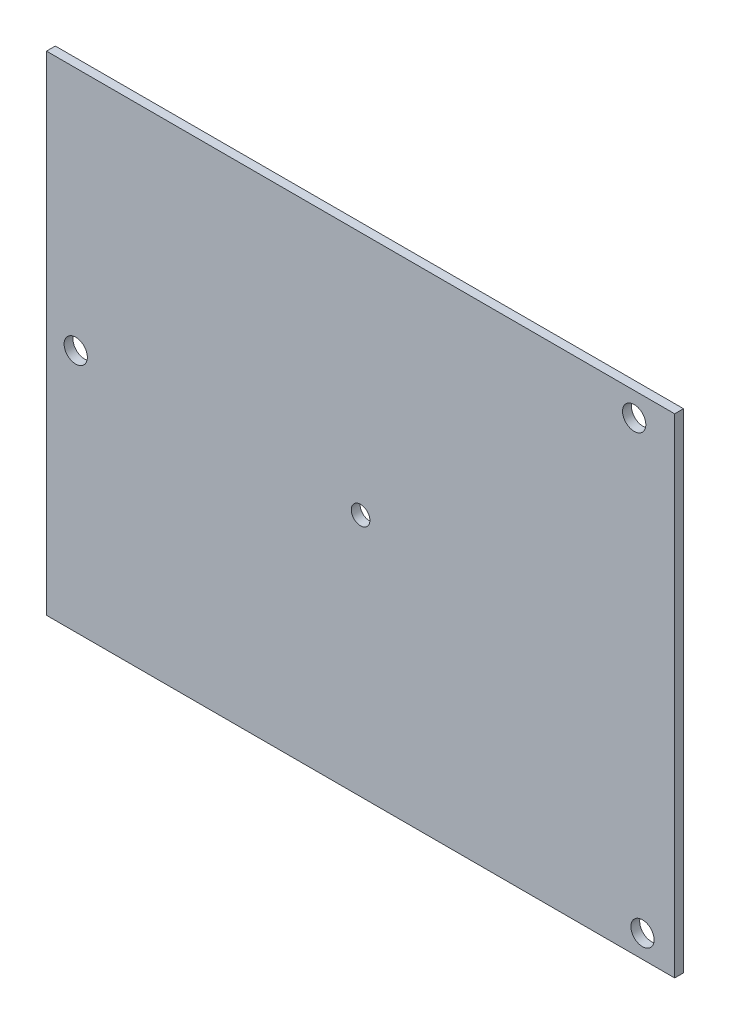
ISO-10303-21;
HEADER;
FILE_DESCRIPTION(('STEP AP214'),'2;1');
FILE_NAME('part.step','',(''),(''),'','','');
FILE_SCHEMA(('AUTOMOTIVE_DESIGN { 1 0 10303 214 1 1 1 1 }'));
ENDSEC;
DATA;
#1=APPLICATION_CONTEXT('core data for automotive mechanical design processes');
#2=APPLICATION_PROTOCOL_DEFINITION('international standard','automotive_design',2000,#1);
#3=PRODUCT_CONTEXT('',#1,'mechanical');
#4=PRODUCT('Part','Part','',(#3));
#5=PRODUCT_RELATED_PRODUCT_CATEGORY('part','',(#4));
#6=PRODUCT_DEFINITION_FORMATION('','',#4);
#7=PRODUCT_DEFINITION_CONTEXT('part definition',#1,'design');
#8=PRODUCT_DEFINITION('design','',#6,#7);
#9=PRODUCT_DEFINITION_SHAPE('','',#8);
#10=(LENGTH_UNIT() NAMED_UNIT(*) SI_UNIT(.MILLI.,.METRE.));
#11=(NAMED_UNIT(*) PLANE_ANGLE_UNIT() SI_UNIT($,.RADIAN.));
#12=(NAMED_UNIT(*) SI_UNIT($,.STERADIAN.) SOLID_ANGLE_UNIT());
#13=UNCERTAINTY_MEASURE_WITH_UNIT(LENGTH_MEASURE(1.E-05),#10,'distance_accuracy_value','');
#14=(GEOMETRIC_REPRESENTATION_CONTEXT(3) GLOBAL_UNCERTAINTY_ASSIGNED_CONTEXT((#13)) GLOBAL_UNIT_ASSIGNED_CONTEXT((#10,
#11,#12)) REPRESENTATION_CONTEXT('',''));
#15=CARTESIAN_POINT('',(0.,0.,0.));
#16=DIRECTION('',(0.,0.,1.));
#17=DIRECTION('',(1.,0.,0.));
#18=AXIS2_PLACEMENT_3D('',#15,#16,#17);
#19=CARTESIAN_POINT('',(-25.884789156632,108.042303174533,-1.89738));
#20=DIRECTION('',(-1.,0.,0.));
#21=DIRECTION('',(0.,-1.,0.));
#22=AXIS2_PLACEMENT_3D('',#19,#20,#21);
#23=PLANE('',#22);
#24=DIRECTION('',(0.,-1.,0.));
#25=VECTOR('',#24,1.);
#26=CARTESIAN_POINT('',(-25.884789156632,108.042303174533,0.));
#27=LINE('',#26,#25);
#28=CARTESIAN_POINT('',(-25.884789156632,108.042303174533,0.));
#29=VERTEX_POINT('',#28);
#30=CARTESIAN_POINT('',(-25.8847891566319,3.04230317453308,0.));
#31=VERTEX_POINT('',#30);
#32=EDGE_CURVE('E100',#29,#31,#27,.T.);
#33=ORIENTED_EDGE('',*,*,#32,.F.);
#34=DIRECTION('',(0.,0.,1.));
#35=VECTOR('',#34,1.);
#36=CARTESIAN_POINT('',(-25.884789156632,108.042303174533,-1.89738));
#37=LINE('',#36,#35);
#38=CARTESIAN_POINT('',(-25.884789156632,108.042303174533,-1.89738));
#39=VERTEX_POINT('',#38);
#40=EDGE_CURVE('E11',#39,#29,#37,.T.);
#41=ORIENTED_EDGE('',*,*,#40,.F.);
#42=DIRECTION('',(0.,-1.,0.));
#43=VECTOR('',#42,1.);
#44=CARTESIAN_POINT('',(-25.884789156632,108.042303174533,-1.89738));
#45=LINE('',#44,#43);
#46=CARTESIAN_POINT('',(-25.8847891566319,3.04230317453308,-1.89738));
#47=VERTEX_POINT('',#46);
#48=EDGE_CURVE('E93',#39,#47,#45,.T.);
#49=ORIENTED_EDGE('',*,*,#48,.T.);
#50=DIRECTION('',(0.,0.,1.));
#51=VECTOR('',#50,1.);
#52=CARTESIAN_POINT('',(-25.8847891566319,3.04230317453308,-1.89738));
#53=LINE('',#52,#51);
#54=EDGE_CURVE('E38',#47,#31,#53,.T.);
#55=ORIENTED_EDGE('',*,*,#54,.T.);
#56=EDGE_LOOP('',(#33,#41,#49,#55));
#57=FACE_BOUND('',#56,.T.);
#58=ADVANCED_FACE('F35',(#57),#23,.T.);
#59=CARTESIAN_POINT('',(-25.884789156632,108.042303174533,-1.89738));
#60=DIRECTION('',(0.,1.,0.));
#61=DIRECTION('',(0.,0.,1.));
#62=AXIS2_PLACEMENT_3D('',#59,#60,#61);
#63=PLANE('',#62);
#64=DIRECTION('',(-1.,0.,0.));
#65=VECTOR('',#64,1.);
#66=CARTESIAN_POINT('',(-25.884789156632,108.042303174533,0.));
#67=LINE('',#66,#65);
#68=CARTESIAN_POINT('',(109.115210843368,108.042303174533,0.));
#69=VERTEX_POINT('',#68);
#70=EDGE_CURVE('E95',#69,#29,#67,.T.);
#71=ORIENTED_EDGE('',*,*,#70,.F.);
#72=DIRECTION('',(0.,0.,1.));
#73=VECTOR('',#72,1.);
#74=CARTESIAN_POINT('',(109.115210843368,108.042303174533,-1.89738));
#75=LINE('',#74,#73);
#76=CARTESIAN_POINT('',(109.115210843368,108.042303174533,-1.89738));
#77=VERTEX_POINT('',#76);
#78=EDGE_CURVE('E44',#77,#69,#75,.T.);
#79=ORIENTED_EDGE('',*,*,#78,.F.);
#80=DIRECTION('',(-1.,0.,0.));
#81=VECTOR('',#80,1.);
#82=CARTESIAN_POINT('',(-25.884789156632,108.042303174533,-1.89738));
#83=LINE('',#82,#81);
#84=EDGE_CURVE('E90',#77,#39,#83,.T.);
#85=ORIENTED_EDGE('',*,*,#84,.T.);
#86=ORIENTED_EDGE('',*,*,#40,.T.);
#87=EDGE_LOOP('',(#71,#79,#85,#86));
#88=FACE_BOUND('',#87,.T.);
#89=ADVANCED_FACE('F111',(#88),#63,.T.);
#90=CARTESIAN_POINT('',(109.115210843368,108.042303174533,-1.89738));
#91=DIRECTION('',(1.,0.,0.));
#92=DIRECTION('',(0.,1.,0.));
#93=AXIS2_PLACEMENT_3D('',#90,#91,#92);
#94=PLANE('',#93);
#95=DIRECTION('',(0.,1.,0.));
#96=VECTOR('',#95,1.);
#97=CARTESIAN_POINT('',(109.115210843368,108.042303174533,0.));
#98=LINE('',#97,#96);
#99=CARTESIAN_POINT('',(109.115210843368,3.04230317453308,0.));
#100=VERTEX_POINT('',#99);
#101=EDGE_CURVE('E85',#100,#69,#98,.T.);
#102=ORIENTED_EDGE('',*,*,#101,.F.);
#103=DIRECTION('',(0.,0.,1.));
#104=VECTOR('',#103,1.);
#105=CARTESIAN_POINT('',(109.115210843368,3.04230317453308,-1.89738));
#106=LINE('',#105,#104);
#107=CARTESIAN_POINT('',(109.115210843368,3.04230317453308,-1.89738));
#108=VERTEX_POINT('',#107);
#109=EDGE_CURVE('E80',#108,#100,#106,.T.);
#110=ORIENTED_EDGE('',*,*,#109,.F.);
#111=DIRECTION('',(0.,1.,0.));
#112=VECTOR('',#111,1.);
#113=CARTESIAN_POINT('',(109.115210843368,108.042303174533,-1.89738));
#114=LINE('',#113,#112);
#115=EDGE_CURVE('E83',#108,#77,#114,.T.);
#116=ORIENTED_EDGE('',*,*,#115,.T.);
#117=ORIENTED_EDGE('',*,*,#78,.T.);
#118=EDGE_LOOP('',(#102,#110,#116,#117));
#119=FACE_BOUND('',#118,.T.);
#120=ADVANCED_FACE('F82',(#119),#94,.T.);
#121=CARTESIAN_POINT('',(-25.8847891566319,3.04230317453308,-1.89738));
#122=DIRECTION('',(0.,-1.,0.));
#123=DIRECTION('',(0.,0.,-1.));
#124=AXIS2_PLACEMENT_3D('',#121,#122,#123);
#125=PLANE('',#124);
#126=DIRECTION('',(1.,0.,0.));
#127=VECTOR('',#126,1.);
#128=CARTESIAN_POINT('',(-25.8847891566319,3.04230317453308,0.));
#129=LINE('',#128,#127);
#130=EDGE_CURVE('E103',#31,#100,#129,.T.);
#131=ORIENTED_EDGE('',*,*,#130,.F.);
#132=ORIENTED_EDGE('',*,*,#54,.F.);
#133=DIRECTION('',(1.,0.,0.));
#134=VECTOR('',#133,1.);
#135=CARTESIAN_POINT('',(-25.8847891566319,3.04230317453308,-1.89738));
#136=LINE('',#135,#134);
#137=EDGE_CURVE('E89',#47,#108,#136,.T.);
#138=ORIENTED_EDGE('',*,*,#137,.T.);
#139=ORIENTED_EDGE('',*,*,#109,.T.);
#140=EDGE_LOOP('',(#131,#132,#138,#139));
#141=FACE_BOUND('',#140,.T.);
#142=ADVANCED_FACE('F92',(#141),#125,.T.);
#143=CARTESIAN_POINT('',(0.,0.,-1.89738));
#144=DIRECTION('',(0.,0.,1.));
#145=DIRECTION('',(1.,0.,0.));
#146=AXIS2_PLACEMENT_3D('',#143,#144,#145);
#147=PLANE('',#146);
#148=CARTESIAN_POINT('',(41.615210843368,55.438832042037,-1.89738));
#149=DIRECTION('',(0.,0.,1.));
#150=DIRECTION('',(1.,0.,0.));
#151=AXIS2_PLACEMENT_3D('',#148,#149,#150);
#152=CIRCLE('',#151,2.);
#153=CARTESIAN_POINT('',(43.615210843368,55.438832042037,-1.89738));
#154=VERTEX_POINT('',#153);
#155=EDGE_CURVE('E155',#154,#154,#152,.T.);
#156=ORIENTED_EDGE('',*,*,#155,.T.);
#157=EDGE_LOOP('',(#156));
#158=FACE_BOUND('',#157,.T.);
#159=CARTESIAN_POINT('',(102.19388286855,7.91527276942949,-1.89738));
#160=DIRECTION('',(0.,0.,1.));
#161=DIRECTION('',(1.,0.,0.));
#162=AXIS2_PLACEMENT_3D('',#159,#160,#161);
#163=CIRCLE('',#162,2.5);
#164=CARTESIAN_POINT('',(104.69388286855,7.91527276942949,-1.89738));
#165=VERTEX_POINT('',#164);
#166=EDGE_CURVE('E159',#165,#165,#163,.T.);
#167=ORIENTED_EDGE('',*,*,#166,.T.);
#168=EDGE_LOOP('',(#167));
#169=FACE_BOUND('',#168,.T.);
#170=CARTESIAN_POINT('',(100.410588716434,102.915619490193,-1.89738));
#171=DIRECTION('',(0.,0.,1.));
#172=DIRECTION('',(1.,0.,0.));
#173=AXIS2_PLACEMENT_3D('',#170,#171,#172);
#174=CIRCLE('',#173,2.5);
#175=CARTESIAN_POINT('',(102.910588716434,102.915619490193,-1.89738));
#176=VERTEX_POINT('',#175);
#177=EDGE_CURVE('E168',#176,#176,#174,.T.);
#178=ORIENTED_EDGE('',*,*,#177,.T.);
#179=EDGE_LOOP('',(#178));
#180=FACE_BOUND('',#179,.T.);
#181=CARTESIAN_POINT('',(-19.5985969886727,55.438832042037,-1.89738));
#182=DIRECTION('',(0.,0.,1.));
#183=DIRECTION('',(1.,0.,0.));
#184=AXIS2_PLACEMENT_3D('',#181,#182,#183);
#185=CIRCLE('',#184,2.5);
#186=CARTESIAN_POINT('',(-17.0985969886727,55.438832042037,-1.89738));
#187=VERTEX_POINT('',#186);
#188=EDGE_CURVE('E104',#187,#187,#185,.T.);
#189=ORIENTED_EDGE('',*,*,#188,.T.);
#190=EDGE_LOOP('',(#189));
#191=FACE_BOUND('',#190,.T.);
#192=ORIENTED_EDGE('',*,*,#48,.F.);
#193=ORIENTED_EDGE('',*,*,#84,.F.);
#194=ORIENTED_EDGE('',*,*,#115,.F.);
#195=ORIENTED_EDGE('',*,*,#137,.F.);
#196=EDGE_LOOP('',(#192,#193,#194,#195));
#197=FACE_BOUND('',#196,.T.);
#198=ADVANCED_FACE('F88',(#158,#169,#180,#191,#197),#147,.F.);
#199=CARTESIAN_POINT('',(0.,0.,0.));
#200=DIRECTION('',(0.,0.,1.));
#201=DIRECTION('',(1.,0.,0.));
#202=AXIS2_PLACEMENT_3D('',#199,#200,#201);
#203=PLANE('',#202);
#204=CARTESIAN_POINT('',(41.615210843368,55.438832042037,0.));
#205=DIRECTION('',(0.,0.,1.));
#206=DIRECTION('',(1.,0.,0.));
#207=AXIS2_PLACEMENT_3D('',#204,#205,#206);
#208=CIRCLE('',#207,2.);
#209=CARTESIAN_POINT('',(43.615210843368,55.438832042037,0.));
#210=VERTEX_POINT('',#209);
#211=EDGE_CURVE('E153',#210,#210,#208,.T.);
#212=ORIENTED_EDGE('',*,*,#211,.F.);
#213=EDGE_LOOP('',(#212));
#214=FACE_BOUND('',#213,.T.);
#215=CARTESIAN_POINT('',(102.19388286855,7.91527276942949,0.));
#216=DIRECTION('',(0.,0.,1.));
#217=DIRECTION('',(1.,0.,0.));
#218=AXIS2_PLACEMENT_3D('',#215,#216,#217);
#219=CIRCLE('',#218,2.5);
#220=CARTESIAN_POINT('',(104.69388286855,7.91527276942949,0.));
#221=VERTEX_POINT('',#220);
#222=EDGE_CURVE('E156',#221,#221,#219,.T.);
#223=ORIENTED_EDGE('',*,*,#222,.F.);
#224=EDGE_LOOP('',(#223));
#225=FACE_BOUND('',#224,.T.);
#226=CARTESIAN_POINT('',(100.410588716434,102.915619490193,0.));
#227=DIRECTION('',(0.,0.,1.));
#228=DIRECTION('',(1.,0.,0.));
#229=AXIS2_PLACEMENT_3D('',#226,#227,#228);
#230=CIRCLE('',#229,2.5);
#231=CARTESIAN_POINT('',(102.910588716434,102.915619490193,0.));
#232=VERTEX_POINT('',#231);
#233=EDGE_CURVE('E165',#232,#232,#230,.T.);
#234=ORIENTED_EDGE('',*,*,#233,.F.);
#235=EDGE_LOOP('',(#234));
#236=FACE_BOUND('',#235,.T.);
#237=CARTESIAN_POINT('',(-19.5985969886727,55.438832042037,0.));
#238=DIRECTION('',(0.,0.,1.));
#239=DIRECTION('',(1.,0.,0.));
#240=AXIS2_PLACEMENT_3D('',#237,#238,#239);
#241=CIRCLE('',#240,2.5);
#242=CARTESIAN_POINT('',(-17.0985969886727,55.438832042037,0.));
#243=VERTEX_POINT('',#242);
#244=EDGE_CURVE('E171',#243,#243,#241,.T.);
#245=ORIENTED_EDGE('',*,*,#244,.F.);
#246=EDGE_LOOP('',(#245));
#247=FACE_BOUND('',#246,.T.);
#248=ORIENTED_EDGE('',*,*,#32,.T.);
#249=ORIENTED_EDGE('',*,*,#130,.T.);
#250=ORIENTED_EDGE('',*,*,#101,.T.);
#251=ORIENTED_EDGE('',*,*,#70,.T.);
#252=EDGE_LOOP('',(#248,#249,#250,#251));
#253=FACE_BOUND('',#252,.T.);
#254=ADVANCED_FACE('F110',(#214,#225,#236,#247,#253),#203,.T.);
#255=CARTESIAN_POINT('',(-19.5985969886727,55.438832042037,-2.));
#256=DIRECTION('',(0.,0.,1.));
#257=DIRECTION('',(1.,0.,0.));
#258=AXIS2_PLACEMENT_3D('',#255,#256,#257);
#259=CYLINDRICAL_SURFACE('',#258,2.5);
#260=ORIENTED_EDGE('',*,*,#244,.T.);
#261=EDGE_LOOP('',(#260));
#262=FACE_BOUND('',#261,.T.);
#263=ORIENTED_EDGE('',*,*,#188,.F.);
#264=EDGE_LOOP('',(#263));
#265=FACE_BOUND('',#264,.T.);
#266=ADVANCED_FACE('F129',(#262,#265),#259,.F.);
#267=CARTESIAN_POINT('',(100.410588716434,102.915619490193,-2.));
#268=DIRECTION('',(0.,0.,1.));
#269=DIRECTION('',(1.,0.,0.));
#270=AXIS2_PLACEMENT_3D('',#267,#268,#269);
#271=CYLINDRICAL_SURFACE('',#270,2.5);
#272=ORIENTED_EDGE('',*,*,#233,.T.);
#273=EDGE_LOOP('',(#272));
#274=FACE_BOUND('',#273,.T.);
#275=ORIENTED_EDGE('',*,*,#177,.F.);
#276=EDGE_LOOP('',(#275));
#277=FACE_BOUND('',#276,.T.);
#278=ADVANCED_FACE('F136',(#274,#277),#271,.F.);
#279=CARTESIAN_POINT('',(102.19388286855,7.91527276942949,-2.));
#280=DIRECTION('',(0.,0.,1.));
#281=DIRECTION('',(1.,0.,0.));
#282=AXIS2_PLACEMENT_3D('',#279,#280,#281);
#283=CYLINDRICAL_SURFACE('',#282,2.5);
#284=ORIENTED_EDGE('',*,*,#222,.T.);
#285=EDGE_LOOP('',(#284));
#286=FACE_BOUND('',#285,.T.);
#287=ORIENTED_EDGE('',*,*,#166,.F.);
#288=EDGE_LOOP('',(#287));
#289=FACE_BOUND('',#288,.T.);
#290=ADVANCED_FACE('F140',(#286,#289),#283,.F.);
#291=CARTESIAN_POINT('',(41.615210843368,55.438832042037,-2.));
#292=DIRECTION('',(0.,0.,1.));
#293=DIRECTION('',(1.,0.,0.));
#294=AXIS2_PLACEMENT_3D('',#291,#292,#293);
#295=CYLINDRICAL_SURFACE('',#294,2.);
#296=ORIENTED_EDGE('',*,*,#211,.T.);
#297=EDGE_LOOP('',(#296));
#298=FACE_BOUND('',#297,.T.);
#299=ORIENTED_EDGE('',*,*,#155,.F.);
#300=EDGE_LOOP('',(#299));
#301=FACE_BOUND('',#300,.T.);
#302=ADVANCED_FACE('F144',(#298,#301),#295,.F.);
#303=CLOSED_SHELL('',(#58,#89,#120,#142,#198,#254,#266,#278,#290,#302));
#304=MANIFOLD_SOLID_BREP('B2',#303);
#305=ADVANCED_BREP_SHAPE_REPRESENTATION('',(#18,#304),#14);
#306=SHAPE_DEFINITION_REPRESENTATION(#9,#305);
ENDSEC;
END-ISO-10303-21;
